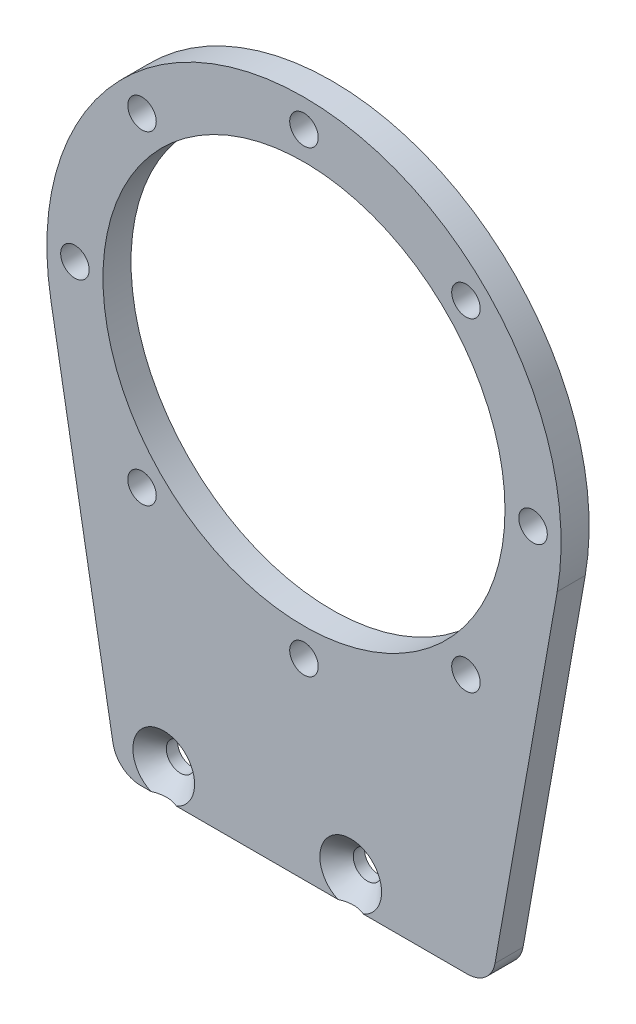
ISO-10303-21;
HEADER;
FILE_DESCRIPTION(('STEP AP214'),'2;1');
FILE_NAME('part.step','',(''),(''),'','','');
FILE_SCHEMA(('AUTOMOTIVE_DESIGN { 1 0 10303 214 1 1 1 1 }'));
ENDSEC;
DATA;
#1=APPLICATION_CONTEXT('core data for automotive mechanical design processes');
#2=APPLICATION_PROTOCOL_DEFINITION('international standard','automotive_design',2000,#1);
#3=PRODUCT_CONTEXT('',#1,'mechanical');
#4=PRODUCT('Part','Part','',(#3));
#5=PRODUCT_RELATED_PRODUCT_CATEGORY('part','',(#4));
#6=PRODUCT_DEFINITION_FORMATION('','',#4);
#7=PRODUCT_DEFINITION_CONTEXT('part definition',#1,'design');
#8=PRODUCT_DEFINITION('design','',#6,#7);
#9=PRODUCT_DEFINITION_SHAPE('','',#8);
#10=(LENGTH_UNIT() NAMED_UNIT(*) SI_UNIT(.MILLI.,.METRE.));
#11=(NAMED_UNIT(*) PLANE_ANGLE_UNIT() SI_UNIT($,.RADIAN.));
#12=(NAMED_UNIT(*) SI_UNIT($,.STERADIAN.) SOLID_ANGLE_UNIT());
#13=UNCERTAINTY_MEASURE_WITH_UNIT(LENGTH_MEASURE(1.E-05),#10,'distance_accuracy_value','');
#14=(GEOMETRIC_REPRESENTATION_CONTEXT(3) GLOBAL_UNCERTAINTY_ASSIGNED_CONTEXT((#13)) GLOBAL_UNIT_ASSIGNED_CONTEXT((#10,
#11,#12)) REPRESENTATION_CONTEXT('',''));
#15=CARTESIAN_POINT('',(0.,0.,0.));
#16=DIRECTION('',(0.,0.,1.));
#17=DIRECTION('',(1.,0.,0.));
#18=AXIS2_PLACEMENT_3D('',#15,#16,#17);
#19=CARTESIAN_POINT('',(20.,-45.,3.));
#20=DIRECTION('',(-0.984851606934607,0.173399285806841,0.));
#21=DIRECTION('',(-0.173399285806841,-0.984851606934607,0.));
#22=AXIS2_PLACEMENT_3D('',#19,#20,#21);
#23=PLANE('',#22);
#24=DIRECTION('',(0.173399285806841,0.984851606934607,0.));
#25=VECTOR('',#24,1.);
#26=CARTESIAN_POINT('',(20.,-45.,3.));
#27=LINE('',#26,#25);
#28=CARTESIAN_POINT('',(20.436609858214,-42.5201978574205,3.));
#29=VERTEX_POINT('',#28);
#30=CARTESIAN_POINT('',(27.0834191907017,-4.76848035968813,3.));
#31=VERTEX_POINT('',#30);
#32=EDGE_CURVE('E130',#29,#31,#27,.T.);
#33=ORIENTED_EDGE('',*,*,#32,.F.);
#34=DIRECTION('',(0.,0.,-1.));
#35=VECTOR('',#34,1.);
#36=CARTESIAN_POINT('',(20.436609858214,-42.5201978574205,3.));
#37=LINE('',#36,#35);
#38=CARTESIAN_POINT('',(20.436609858214,-42.5201978574205,0.));
#39=VERTEX_POINT('',#38);
#40=EDGE_CURVE('E45',#29,#39,#37,.T.);
#41=ORIENTED_EDGE('',*,*,#40,.T.);
#42=DIRECTION('',(0.173399285806841,0.984851606934607,0.));
#43=VECTOR('',#42,1.);
#44=CARTESIAN_POINT('',(20.,-45.,0.));
#45=LINE('',#44,#43);
#46=CARTESIAN_POINT('',(27.0834191907017,-4.76848035968813,0.));
#47=VERTEX_POINT('',#46);
#48=EDGE_CURVE('E142',#39,#47,#45,.T.);
#49=ORIENTED_EDGE('',*,*,#48,.T.);
#50=DIRECTION('',(0.,0.,-1.));
#51=VECTOR('',#50,1.);
#52=CARTESIAN_POINT('',(27.0834191907017,-4.76848035968813,3.));
#53=LINE('',#52,#51);
#54=EDGE_CURVE('E121',#31,#47,#53,.T.);
#55=ORIENTED_EDGE('',*,*,#54,.F.);
#56=EDGE_LOOP('',(#33,#41,#49,#55));
#57=FACE_BOUND('',#56,.T.);
#58=ADVANCED_FACE('F36',(#57),#23,.F.);
#59=CARTESIAN_POINT('',(0.,0.,3.));
#60=DIRECTION('',(0.,0.,-1.));
#61=DIRECTION('',(-1.,0.,0.));
#62=AXIS2_PLACEMENT_3D('',#59,#60,#61);
#63=CYLINDRICAL_SURFACE('',#62,27.5);
#64=CARTESIAN_POINT('',(0.,0.,0.));
#65=DIRECTION('',(0.,0.,1.));
#66=DIRECTION('',(1.,0.,0.));
#67=AXIS2_PLACEMENT_3D('',#64,#65,#66);
#68=CIRCLE('',#67,27.5);
#69=CARTESIAN_POINT('',(-27.0834191907017,-4.76848035968814,0.));
#70=VERTEX_POINT('',#69);
#71=EDGE_CURVE('E331',#47,#70,#68,.T.);
#72=ORIENTED_EDGE('',*,*,#71,.T.);
#73=DIRECTION('',(0.,0.,-1.));
#74=VECTOR('',#73,1.);
#75=CARTESIAN_POINT('',(-27.0834191907017,-4.76848035968814,3.));
#76=LINE('',#75,#74);
#77=CARTESIAN_POINT('',(-27.0834191907017,-4.76848035968814,3.));
#78=VERTEX_POINT('',#77);
#79=EDGE_CURVE('E117',#78,#70,#76,.T.);
#80=ORIENTED_EDGE('',*,*,#79,.F.);
#81=CARTESIAN_POINT('',(0.,0.,3.));
#82=DIRECTION('',(0.,0.,1.));
#83=DIRECTION('',(1.,0.,0.));
#84=AXIS2_PLACEMENT_3D('',#81,#82,#83);
#85=CIRCLE('',#84,27.5);
#86=EDGE_CURVE('E128',#31,#78,#85,.T.);
#87=ORIENTED_EDGE('',*,*,#86,.F.);
#88=ORIENTED_EDGE('',*,*,#54,.T.);
#89=EDGE_LOOP('',(#72,#80,#87,#88));
#90=FACE_BOUND('',#89,.T.);
#91=ADVANCED_FACE('F273',(#90),#63,.T.);
#92=CARTESIAN_POINT('',(-20.,-45.,3.));
#93=DIRECTION('',(0.984851606934607,0.173399285806841,0.));
#94=DIRECTION('',(-0.173399285806841,0.984851606934607,0.));
#95=AXIS2_PLACEMENT_3D('',#92,#93,#94);
#96=PLANE('',#95);
#97=DIRECTION('',(0.173399285806841,-0.984851606934607,0.));
#98=VECTOR('',#97,1.);
#99=CARTESIAN_POINT('',(-20.,-45.,0.));
#100=LINE('',#99,#98);
#101=CARTESIAN_POINT('',(-20.436609858214,-42.5201978574205,0.));
#102=VERTEX_POINT('',#101);
#103=EDGE_CURVE('E329',#70,#102,#100,.T.);
#104=ORIENTED_EDGE('',*,*,#103,.T.);
#105=DIRECTION('',(0.,0.,-1.));
#106=VECTOR('',#105,1.);
#107=CARTESIAN_POINT('',(-20.436609858214,-42.5201978574205,3.));
#108=LINE('',#107,#106);
#109=CARTESIAN_POINT('',(-20.436609858214,-42.5201978574205,3.));
#110=VERTEX_POINT('',#109);
#111=EDGE_CURVE('E288',#102,#110,#108,.F.);
#112=ORIENTED_EDGE('',*,*,#111,.T.);
#113=DIRECTION('',(0.173399285806841,-0.984851606934607,0.));
#114=VECTOR('',#113,1.);
#115=CARTESIAN_POINT('',(-20.,-45.,3.));
#116=LINE('',#115,#114);
#117=EDGE_CURVE('E125',#78,#110,#116,.T.);
#118=ORIENTED_EDGE('',*,*,#117,.F.);
#119=ORIENTED_EDGE('',*,*,#79,.T.);
#120=EDGE_LOOP('',(#104,#112,#118,#119));
#121=FACE_BOUND('',#120,.T.);
#122=ADVANCED_FACE('F207',(#121),#96,.F.);
#123=CARTESIAN_POINT('',(-20.,-45.,3.));
#124=DIRECTION('',(0.,1.,0.));
#125=DIRECTION('',(-1.,0.,0.));
#126=AXIS2_PLACEMENT_3D('',#123,#124,#125);
#127=PLANE('',#126);
#128=DIRECTION('',(1.,0.,0.));
#129=VECTOR('',#128,1.);
#130=CARTESIAN_POINT('',(-20.,-45.,3.));
#131=LINE('',#130,#129);
#132=CARTESIAN_POINT('',(-13.6252272915131,-45.,3.));
#133=VERTEX_POINT('',#132);
#134=CARTESIAN_POINT('',(3.62522729151328,-45.,3.));
#135=VERTEX_POINT('',#134);
#136=EDGE_CURVE('E58',#133,#135,#131,.T.);
#137=ORIENTED_EDGE('',*,*,#136,.F.);
#138=CARTESIAN_POINT('',(-19.1508860129065,-45.,4.82150902490101));
#139=CARTESIAN_POINT('',(-19.0522589239576,-45.,4.7415906121361));
#140=CARTESIAN_POINT('',(-18.9531658036234,-45.,4.66223927028797));
#141=CARTESIAN_POINT('',(-18.7538370988954,-45.,4.50494526327476));
#142=CARTESIAN_POINT('',(-18.6536012929923,-45.,4.4270028790763));
#143=CARTESIAN_POINT('',(-18.4510624969044,-45.,4.27225770788909));
#144=CARTESIAN_POINT('',(-18.3487496614384,-45.,4.19546776946498));
#145=CARTESIAN_POINT('',(-18.1425481151415,-45.,4.04404278391068));
#146=CARTESIAN_POINT('',(-18.0386595087374,-45.,3.96940759492787));
#147=CARTESIAN_POINT('',(-17.8201887261708,-45.,3.81665595341967));
#148=CARTESIAN_POINT('',(-17.7054416805852,-45.,3.73877417270123));
#149=CARTESIAN_POINT('',(-17.4732515877197,-45.,3.58706104918413));
#150=CARTESIAN_POINT('',(-17.3558080124541,-45.,3.51323050938684));
#151=CARTESIAN_POINT('',(-17.1180615491722,-45.,3.37112041781764));
#152=CARTESIAN_POINT('',(-16.9977682701096,-45.,3.30282491480009));
#153=CARTESIAN_POINT('',(-16.753459335704,-45.,3.17331164024902));
#154=CARTESIAN_POINT('',(-16.6294456757632,-45.,3.11209015717064));
#155=CARTESIAN_POINT('',(-16.3956113355616,-45.,3.00733640420947));
#156=CARTESIAN_POINT('',(-16.2863687778311,-45.,2.96252657017206));
#157=CARTESIAN_POINT('',(-16.0646355941592,-45.,2.88163524822732));
#158=CARTESIAN_POINT('',(-15.9521447639429,-45.,2.84555431059981));
#159=CARTESIAN_POINT('',(-15.7265795792497,-45.,2.78486376508149));
#160=CARTESIAN_POINT('',(-15.6135667549767,-45.,2.76002979511898));
#161=CARTESIAN_POINT('',(-15.3855224244365,-45.,2.72258306176409));
#162=CARTESIAN_POINT('',(-15.2704916638217,-45.,2.70996587708434));
#163=CARTESIAN_POINT('',(-15.0478592490485,-45.,2.69846838235778));
#164=CARTESIAN_POINT('',(-14.9403045307317,-45.,2.69868375553161));
#165=CARTESIAN_POINT('',(-14.725842911363,-45.,2.71059719396083));
#166=CARTESIAN_POINT('',(-14.6189360303921,-45.,2.72229561334384));
#167=CARTESIAN_POINT('',(-14.4059364127219,-45.,2.75642733136527));
#168=CARTESIAN_POINT('',(-14.2998586797189,-45.,2.77895246227706));
#169=CARTESIAN_POINT('',(-14.090139990422,-45.,2.83330190120473));
#170=CARTESIAN_POINT('',(-13.9864996608889,-45.,2.86512857339727));
#171=CARTESIAN_POINT('',(-13.6896269574193,-45.,2.96859641772816));
#172=CARTESIAN_POINT('',(-13.4998859416964,-45.,3.05025935947392));
#173=CARTESIAN_POINT('',(-13.2221139564557,-45.,3.18631355502083));
#174=CARTESIAN_POINT('',(-13.1305739158924,-45.,3.23398013062563));
#175=CARTESIAN_POINT('',(-12.9495108226937,-45.,3.33300917158717));
#176=CARTESIAN_POINT('',(-12.8599874640647,-45.,3.38437107122038));
#177=CARTESIAN_POINT('',(-12.6814996168162,-45.,3.49081029949074));
#178=CARTESIAN_POINT('',(-12.592560311294,-45.,3.54592943734986));
#179=CARTESIAN_POINT('',(-12.4162791184772,-45.,3.65866432764966));
#180=CARTESIAN_POINT('',(-12.3289372668912,-45.,3.71628013580284));
#181=CARTESIAN_POINT('',(-12.1557220917774,-45.,3.83350405674633));
#182=CARTESIAN_POINT('',(-12.0698474993291,-45.,3.8931103009978));
#183=CARTESIAN_POINT('',(-11.8993042810776,-45.,4.01401202334735));
#184=CARTESIAN_POINT('',(-11.8146356035005,-45.,4.07530742859053));
#185=CARTESIAN_POINT('',(-11.6246641299745,-45.,4.21528143960808));
#186=CARTESIAN_POINT('',(-11.5196642043875,-45.,4.29437065836093));
#187=CARTESIAN_POINT('',(-11.311047978828,-45.,4.45435587527189));
#188=CARTESIAN_POINT('',(-11.2074317330192,-45.,4.53525194382896));
#189=CARTESIAN_POINT('',(-10.8982966873547,-45.,4.78016475749427));
#190=CARTESIAN_POINT('',(-10.6945224866147,-45.,4.94638302543725));
#191=CARTESIAN_POINT('',(-10.290242088986,-45.,5.28295074125445));
#192=CARTESIAN_POINT('',(-10.0897378197545,-45.,5.45330248842023));
#193=CARTESIAN_POINT('',(-9.69125122070904,-45.,5.79693738204447));
#194=CARTESIAN_POINT('',(-9.49326897003109,-45.,5.97022062009199));
#195=CARTESIAN_POINT('',(-9.09874452273209,-45.,6.31939365427462));
#196=CARTESIAN_POINT('',(-8.90220711507222,-45.,6.49528884888159));
#197=CARTESIAN_POINT('',(-8.51064142991948,-45.,6.84875582087548));
#198=CARTESIAN_POINT('',(-8.3156131800658,-45.,7.02632762883681));
#199=CARTESIAN_POINT('',(-7.73244703544708,-45.,7.56085126104374));
#200=CARTESIAN_POINT('',(-7.34608461642984,-45.,7.9197390262219));
#201=CARTESIAN_POINT('',(-6.62771800127958,-45.,8.59278923550418));
#202=CARTESIAN_POINT('',(-6.29532815840837,-45.,8.90654168888206));
#203=CARTESIAN_POINT('',(-5.63221724310256,-45.,9.5358745233835));
#204=CARTESIAN_POINT('',(-5.30149635028805,-45.,9.85145509372474));
#205=CARTESIAN_POINT('',(-4.64278279309385,-45.,10.4825349477892));
#206=CARTESIAN_POINT('',(-4.31478453306716,-45.,10.7980283978303));
#207=CARTESIAN_POINT('',(-3.65980728215403,-45.,11.4299939790683));
#208=CARTESIAN_POINT('',(-3.33282817461386,-45.,11.7464659893283));
#209=CARTESIAN_POINT('',(-3.00620195253253,-45.,12.063300190622));
#210=B_SPLINE_CURVE_WITH_KNOTS('',3,(#138,#139,#140,#141,#142,#143,#144,#145,#146,#147,#148,
#149,#150,#151,#152,#153,#154,#155,#156,#157,#158,#159,#160,#161,#162,#163,#164,#165,#166,#167,
#168,#169,#170,#171,#172,#173,#174,#175,#176,#177,#178,#179,#180,#181,#182,#183,#184,#185,#186,
#187,#188,#189,#190,#191,#192,#193,#194,#195,#196,#197,#198,#199,#200,#201,#202,#203,#204,#205,
#206,#207,#208,#209),.UNSPECIFIED.,.F.,.F.,(4,2,2,2,2,2,2,2,2,2,2,2,2,2,2,2,2,2,2,2,2,2,2,2,2,2,
2,2,2,2,2,2,2,2,2,4),(0.,0.380831228692744,0.761737581045333,1.1454870746135,1.52921124710498,
1.94518824022884,2.3612473890146,2.77606139361267,3.19065675878268,3.5445929654488,
3.8985514788551,4.24509904888171,4.59152115548498,4.91356170339058,5.23561218307134,
5.56044383963398,5.88535813070529,6.5032823542334,6.81287268782773,7.12241572614238,
7.43627338380023,7.750138048713,8.06371592505691,8.37728029763189,8.77161606250795,
9.16596721849107,9.95478521299294,10.7440525382388,11.5333445684055,12.3245940288198,
13.1158579462859,14.6978103234965,16.069048800809,17.4404318374958,18.8057393721757,
20.1708844273189),.UNSPECIFIED.);
#211=CARTESIAN_POINT('',(-16.3747727084869,-45.,3.));
#212=VERTEX_POINT('',#211);
#213=EDGE_CURVE('E51',#133,#212,#210,.F.);
#214=ORIENTED_EDGE('',*,*,#213,.T.);
#215=CARTESIAN_POINT('',(-17.4820550374102,-45.,3.));
#216=VERTEX_POINT('',#215);
#217=EDGE_CURVE('E108',#216,#212,#131,.T.);
#218=ORIENTED_EDGE('',*,*,#217,.F.);
#219=DIRECTION('',(0.,0.,-1.));
#220=VECTOR('',#219,1.);
#221=CARTESIAN_POINT('',(-17.4820550374102,-45.,3.));
#222=LINE('',#221,#220);
#223=CARTESIAN_POINT('',(-17.4820550374102,-45.,0.));
#224=VERTEX_POINT('',#223);
#225=EDGE_CURVE('E289',#216,#224,#222,.T.);
#226=ORIENTED_EDGE('',*,*,#225,.T.);
#227=DIRECTION('',(1.,0.,0.));
#228=VECTOR('',#227,1.);
#229=CARTESIAN_POINT('',(-20.,-45.,0.));
#230=LINE('',#229,#228);
#231=CARTESIAN_POINT('',(17.4820550374102,-45.,0.));
#232=VERTEX_POINT('',#231);
#233=EDGE_CURVE('E134',#224,#232,#230,.T.);
#234=ORIENTED_EDGE('',*,*,#233,.T.);
#235=DIRECTION('',(0.,0.,-1.));
#236=VECTOR('',#235,1.);
#237=CARTESIAN_POINT('',(17.4820550374102,-45.,3.));
#238=LINE('',#237,#236);
#239=CARTESIAN_POINT('',(17.4820550374102,-45.,3.));
#240=VERTEX_POINT('',#239);
#241=EDGE_CURVE('E337',#232,#240,#238,.F.);
#242=ORIENTED_EDGE('',*,*,#241,.T.);
#243=CARTESIAN_POINT('',(6.37477270848671,-45.,3.));
#244=VERTEX_POINT('',#243);
#245=EDGE_CURVE('E119',#244,#240,#131,.T.);
#246=ORIENTED_EDGE('',*,*,#245,.F.);
#247=CARTESIAN_POINT('',(-6.18061670059786,-45.,11.2761042585875));
#248=CARTESIAN_POINT('',(-5.8914359782964,-45.,10.9968284293495));
#249=CARTESIAN_POINT('',(-5.60191499361549,-45.,10.7179033624293));
#250=CARTESIAN_POINT('',(-5.0219320848842,-45.,10.1609948468987));
#251=CARTESIAN_POINT('',(-4.7314700995584,-45.,9.88301146212128));
#252=CARTESIAN_POINT('',(-4.14848308527101,-45.,9.32740580500053));
#253=CARTESIAN_POINT('',(-3.85595445417461,-45.,9.04978730807811));
#254=CARTESIAN_POINT('',(-3.26937127500692,-45.,8.49619795936264));
#255=CARTESIAN_POINT('',(-2.97531680922507,-45.,8.22022702040681));
#256=CARTESIAN_POINT('',(-2.34841034771812,-45.,7.63627343134944));
#257=CARTESIAN_POINT('',(-2.01528562759455,-45.,7.3285825689086));
#258=CARTESIAN_POINT('',(-1.51272018892,-45.,6.87013745429984));
#259=CARTESIAN_POINT('',(-1.34470270914723,-45.,6.71782343020518));
#260=CARTESIAN_POINT('',(-1.00749357345925,-45.,6.41450168261448));
#261=CARTESIAN_POINT('',(-0.83830192674175,-45.,6.26349394890655));
#262=CARTESIAN_POINT('',(-0.498758280129591,-45.,5.96338930928497));
#263=CARTESIAN_POINT('',(-0.328408834084627,-45.,5.81428951787767));
#264=CARTESIAN_POINT('',(0.0141201774465905,-45.,5.5182102408462));
#265=CARTESIAN_POINT('',(0.186299699498851,-45.,5.37123070509537));
#266=CARTESIAN_POINT('',(0.532960832064427,-45.,5.08010971511442));
#267=CARTESIAN_POINT('',(0.70744175586468,-45.,4.93596744489988));
#268=CARTESIAN_POINT('',(1.05945862850155,-45.,4.65147233563209));
#269=CARTESIAN_POINT('',(1.23699427948962,-45.,4.51111913051926));
#270=CARTESIAN_POINT('',(1.51309982180886,-45.,4.29941977398574));
#271=CARTESIAN_POINT('',(1.61021671689676,-45.,4.22617934259312));
#272=CARTESIAN_POINT('',(1.80585013617963,-45.,4.08157995364531));
#273=CARTESIAN_POINT('',(1.90436670561209,-45.,4.01022105711518));
#274=CARTESIAN_POINT('',(2.10318884218363,-45.,3.86971942036077));
#275=CARTESIAN_POINT('',(2.20349681414434,-45.,3.80058007248981));
#276=CARTESIAN_POINT('',(2.40605732281094,-45.,3.66520610131397));
#277=CARTESIAN_POINT('',(2.5083097885004,-45.,3.59897137221813));
#278=CARTESIAN_POINT('',(2.71338388615321,-45.,3.47124437264389));
#279=CARTESIAN_POINT('',(2.81616749242238,-45.,3.40969137313386));
#280=CARTESIAN_POINT('',(3.02434529569787,-45.,3.29108487762925));
#281=CARTESIAN_POINT('',(3.12974000368696,-45.,3.23403227163195));
#282=CARTESIAN_POINT('',(3.34323726284334,-45.,3.12584483352875));
#283=CARTESIAN_POINT('',(3.45133282028706,-45.,3.07469632468184));
#284=CARTESIAN_POINT('',(3.67070539180562,-45.,2.97982574972149));
#285=CARTESIAN_POINT('',(3.78198035559313,-45.,2.93609901844546));
#286=CARTESIAN_POINT('',(3.98745941627403,-45.,2.86507518637899));
#287=CARTESIAN_POINT('',(4.08112674605892,-45.,2.83623737364351));
#288=CARTESIAN_POINT('',(4.270480159168,-45.,2.7860772914338));
#289=CARTESIAN_POINT('',(4.36616616110235,-45.,2.76475471956765));
#290=CARTESIAN_POINT('',(4.55853045685127,-45.,2.7308401624933));
#291=CARTESIAN_POINT('',(4.65519988372438,-45.,2.71819869094007));
#292=CARTESIAN_POINT('',(4.84931137012863,-45.,2.70222563762937));
#293=CARTESIAN_POINT('',(4.94675335674288,-45.,2.69889318750128));
#294=CARTESIAN_POINT('',(5.13893623890647,-45.,2.70171814635444));
#295=CARTESIAN_POINT('',(5.23368091646792,-45.,2.70762882766535));
#296=CARTESIAN_POINT('',(5.42221877331271,-45.,2.72811507032909));
#297=CARTESIAN_POINT('',(5.51601189276624,-45.,2.7426911731336));
#298=CARTESIAN_POINT('',(5.70254535713979,-45.,2.77979863135181));
#299=CARTESIAN_POINT('',(5.795276595249,-45.,2.80237507316296));
#300=CARTESIAN_POINT('',(5.9787707141461,-45.,2.85440076211779));
#301=CARTESIAN_POINT('',(6.06953344033122,-45.,2.88385054695837));
#302=CARTESIAN_POINT('',(6.26068128437981,-45.,2.95274635741036));
#303=CARTESIAN_POINT('',(6.36077439559764,-45.,2.99299568551352));
#304=CARTESIAN_POINT('',(6.55836680433632,-45.,3.07943905313335));
#305=CARTESIAN_POINT('',(6.65586523732688,-45.,3.12563504484086));
#306=CARTESIAN_POINT('',(6.8486236521163,-45.,3.22284985154173));
#307=CARTESIAN_POINT('',(6.9438793972132,-45.,3.27387700261107));
#308=CARTESIAN_POINT('',(7.13222755442895,-45.,3.37971851133287));
#309=CARTESIAN_POINT('',(7.22532033634855,-45.,3.43453221513774));
#310=CARTESIAN_POINT('',(7.41085290984727,-45.,3.54795428080618));
#311=CARTESIAN_POINT('',(7.50326775247536,-45.,3.60660326351876));
#312=CARTESIAN_POINT('',(7.68643863774753,-45.,3.72643224728756));
#313=CARTESIAN_POINT('',(7.77719463615234,-45.,3.78761231570305));
#314=CARTESIAN_POINT('',(7.95718224207088,-45.,3.91197069670986));
#315=CARTESIAN_POINT('',(8.04641535057457,-45.,3.97514684299531));
#316=CARTESIAN_POINT('',(8.22364562865434,-45.,4.10319773861951));
#317=CARTESIAN_POINT('',(8.31164284567419,-45.,4.16807242247894));
#318=CARTESIAN_POINT('',(8.60428647214979,-45.,4.3874665267982));
#319=CARTESIAN_POINT('',(8.80656358954741,-45.,4.54514638586982));
#320=CARTESIAN_POINT('',(9.20697912450419,-45.,4.86569108327737));
#321=CARTESIAN_POINT('',(9.40511686115475,-45.,5.02855676370636));
#322=CARTESIAN_POINT('',(9.79841178829449,-45.,5.35802321404988));
#323=CARTESIAN_POINT('',(9.99356754771611,-45.,5.52462568813699));
#324=CARTESIAN_POINT('',(10.3815648867815,-45.,5.86050564328988));
#325=CARTESIAN_POINT('',(10.5744064055927,-45.,6.0297831944035));
#326=CARTESIAN_POINT('',(10.9587249521017,-45.,6.37072136850707));
#327=CARTESIAN_POINT('',(11.1501980586121,-45.,6.54238640454117));
#328=CARTESIAN_POINT('',(11.5317363241419,-45.,6.88727715839225));
#329=CARTESIAN_POINT('',(11.7218014629661,-45.,7.0605028985165));
#330=CARTESIAN_POINT('',(12.2902143717919,-45.,7.58189622425851));
#331=CARTESIAN_POINT('',(12.6668936964081,-45.,7.93188188445103));
#332=CARTESIAN_POINT('',(13.3732010694563,-45.,8.59366505258181));
#333=CARTESIAN_POINT('',(13.703155288647,-45.,8.90511573971248));
#334=CARTESIAN_POINT('',(14.3614114763272,-45.,9.52981458315141));
#335=CARTESIAN_POINT('',(14.6897132995227,-45.,9.843062892514));
#336=CARTESIAN_POINT('',(15.3437775371707,-45.,10.4696307435521));
#337=CARTESIAN_POINT('',(15.6695448608986,-45.,10.7829451664577));
#338=CARTESIAN_POINT('',(16.3200757556826,-45.,11.4105498443116));
#339=CARTESIAN_POINT('',(16.6448394235426,-45.,11.7248399988907));
#340=CARTESIAN_POINT('',(16.9692526784864,-45.,12.0394898468881));
#341=B_SPLINE_CURVE_WITH_KNOTS('',3,(#247,#248,#249,#250,#251,#252,#253,#254,#255,#256,#257,
#258,#259,#260,#261,#262,#263,#264,#265,#266,#267,#268,#269,#270,#271,#272,#273,#274,#275,#276,
#277,#278,#279,#280,#281,#282,#283,#284,#285,#286,#287,#288,#289,#290,#291,#292,#293,#294,#295,
#296,#297,#298,#299,#300,#301,#302,#303,#304,#305,#306,#307,#308,#309,#310,#311,#312,#313,#314,
#315,#316,#317,#318,#319,#320,#321,#322,#323,#324,#325,#326,#327,#328,#329,#330,#331,#332,#333,
#334,#335,#336,#337,#338,#339,#340),.UNSPECIFIED.,.F.,.F.,(4,2,2,2,2,2,2,2,2,2,2,2,2,2,2,2,2,2,
2,2,2,2,2,2,2,2,2,2,2,2,2,2,2,2,2,2,2,2,2,2,2,2,2,2,2,2,4),(0.,1.2060627764022,2.4122057336306,
3.62207878706078,4.83188725555652,6.19230458826314,6.87264126221327,7.55297261282554,
8.23211141120563,8.91123412711992,9.59015858936811,10.2690172246445,10.6339142941056,
10.9988231839941,11.3642655416603,11.7296945782481,12.0890206356012,12.4484175760035,
12.8069645226723,13.1652852533669,13.4590426211787,13.7527881676802,14.0448450079142,
14.336874603389,14.6212410825542,14.9056253319908,15.1916384231198,15.4776738963605,
15.8010779719719,16.1245884878204,16.4486677576676,16.772691205945,17.1010031051629,
17.4293237473051,17.7572995449476,18.0852627175525,18.8545364666871,19.6239357769,
20.393693409931,21.1634712328482,21.9349376784546,22.7064151682337,24.2489111984032,
25.6100960777974,26.9713986244381,28.3273508554696,29.6831679444807),.UNSPECIFIED.);
#342=EDGE_CURVE('E11',#244,#135,#341,.F.);
#343=ORIENTED_EDGE('',*,*,#342,.T.);
#344=EDGE_LOOP('',(#137,#214,#218,#226,#234,#242,#246,#343));
#345=FACE_BOUND('',#344,.T.);
#346=ADVANCED_FACE('F106',(#345),#127,.F.);
#347=CARTESIAN_POINT('',(0.,0.,3.));
#348=DIRECTION('',(0.,0.,1.));
#349=DIRECTION('',(1.,0.,0.));
#350=AXIS2_PLACEMENT_3D('',#347,#348,#349);
#351=PLANE('',#350);
#352=CARTESIAN_POINT('',(-15.,-42.,3.));
#353=DIRECTION('',(0.,0.,1.));
#354=DIRECTION('',(1.,0.,0.));
#355=AXIS2_PLACEMENT_3D('',#352,#353,#354);
#356=CIRCLE('',#355,3.3);
#357=EDGE_CURVE('E100',#133,#212,#356,.T.);
#358=ORIENTED_EDGE('',*,*,#357,.F.);
#359=ORIENTED_EDGE('',*,*,#136,.T.);
#360=CARTESIAN_POINT('',(5.,-42.,3.));
#361=DIRECTION('',(0.,0.,1.));
#362=DIRECTION('',(1.,0.,0.));
#363=AXIS2_PLACEMENT_3D('',#360,#361,#362);
#364=CIRCLE('',#363,3.3);
#365=EDGE_CURVE('E110',#244,#135,#364,.T.);
#366=ORIENTED_EDGE('',*,*,#365,.F.);
#367=ORIENTED_EDGE('',*,*,#245,.T.);
#368=CARTESIAN_POINT('',(17.4820550374102,-42.,3.));
#369=DIRECTION('',(0.,0.,1.));
#370=DIRECTION('',(1.,0.,0.));
#371=AXIS2_PLACEMENT_3D('',#368,#369,#370);
#372=CIRCLE('',#371,3.);
#373=EDGE_CURVE('E290',#240,#29,#372,.T.);
#374=ORIENTED_EDGE('',*,*,#373,.T.);
#375=ORIENTED_EDGE('',*,*,#32,.T.);
#376=ORIENTED_EDGE('',*,*,#86,.T.);
#377=ORIENTED_EDGE('',*,*,#117,.T.);
#378=CARTESIAN_POINT('',(-17.4820550374102,-42.,3.));
#379=DIRECTION('',(0.,0.,1.));
#380=DIRECTION('',(1.,0.,0.));
#381=AXIS2_PLACEMENT_3D('',#378,#379,#380);
#382=CIRCLE('',#381,3.);
#383=EDGE_CURVE('E116',#110,#216,#382,.T.);
#384=ORIENTED_EDGE('',*,*,#383,.T.);
#385=ORIENTED_EDGE('',*,*,#217,.T.);
#386=EDGE_LOOP('',(#358,#359,#366,#367,#374,#375,#376,#377,#384,#385));
#387=FACE_BOUND('',#386,.T.);
#388=CARTESIAN_POINT('',(24.5,0.,3.));
#389=DIRECTION('',(0.,0.,1.));
#390=DIRECTION('',(1.,0.,0.));
#391=AXIS2_PLACEMENT_3D('',#388,#389,#390);
#392=CIRCLE('',#391,1.525);
#393=CARTESIAN_POINT('',(26.025,0.,3.));
#394=VERTEX_POINT('',#393);
#395=EDGE_CURVE('E168',#394,#394,#392,.T.);
#396=ORIENTED_EDGE('',*,*,#395,.F.);
#397=EDGE_LOOP('',(#396));
#398=FACE_BOUND('',#397,.T.);
#399=CARTESIAN_POINT('',(17.3241161390704,-17.3241161390705,3.));
#400=DIRECTION('',(0.,0.,1.));
#401=DIRECTION('',(1.,0.,0.));
#402=AXIS2_PLACEMENT_3D('',#399,#400,#401);
#403=CIRCLE('',#402,1.525);
#404=CARTESIAN_POINT('',(18.8491161390704,-17.3241161390705,3.));
#405=VERTEX_POINT('',#404);
#406=EDGE_CURVE('E162',#405,#405,#403,.T.);
#407=ORIENTED_EDGE('',*,*,#406,.F.);
#408=EDGE_LOOP('',(#407));
#409=FACE_BOUND('',#408,.T.);
#410=CARTESIAN_POINT('',(0.,-24.5,3.));
#411=DIRECTION('',(0.,0.,1.));
#412=DIRECTION('',(1.,0.,0.));
#413=AXIS2_PLACEMENT_3D('',#410,#411,#412);
#414=CIRCLE('',#413,1.525);
#415=CARTESIAN_POINT('',(1.52499999999995,-24.5,3.));
#416=VERTEX_POINT('',#415);
#417=EDGE_CURVE('E156',#416,#416,#414,.T.);
#418=ORIENTED_EDGE('',*,*,#417,.F.);
#419=EDGE_LOOP('',(#418));
#420=FACE_BOUND('',#419,.T.);
#421=CARTESIAN_POINT('',(-17.3241161390704,-17.3241161390704,3.));
#422=DIRECTION('',(0.,0.,1.));
#423=DIRECTION('',(1.,0.,0.));
#424=AXIS2_PLACEMENT_3D('',#421,#422,#423);
#425=CIRCLE('',#424,1.525);
#426=CARTESIAN_POINT('',(-15.7991161390704,-17.3241161390704,3.));
#427=VERTEX_POINT('',#426);
#428=EDGE_CURVE('E149',#427,#427,#425,.T.);
#429=ORIENTED_EDGE('',*,*,#428,.F.);
#430=EDGE_LOOP('',(#429));
#431=FACE_BOUND('',#430,.T.);
#432=CARTESIAN_POINT('',(-24.5,0.,3.));
#433=DIRECTION('',(0.,0.,1.));
#434=DIRECTION('',(1.,0.,0.));
#435=AXIS2_PLACEMENT_3D('',#432,#433,#434);
#436=CIRCLE('',#435,1.525);
#437=CARTESIAN_POINT('',(-22.975,0.,3.));
#438=VERTEX_POINT('',#437);
#439=EDGE_CURVE('E186',#438,#438,#436,.T.);
#440=ORIENTED_EDGE('',*,*,#439,.F.);
#441=EDGE_LOOP('',(#440));
#442=FACE_BOUND('',#441,.T.);
#443=CARTESIAN_POINT('',(-17.3241161390704,17.3241161390704,3.));
#444=DIRECTION('',(0.,0.,1.));
#445=DIRECTION('',(1.,0.,0.));
#446=AXIS2_PLACEMENT_3D('',#443,#444,#445);
#447=CIRCLE('',#446,1.525);
#448=CARTESIAN_POINT('',(-15.7991161390704,17.3241161390704,3.));
#449=VERTEX_POINT('',#448);
#450=EDGE_CURVE('E180',#449,#449,#447,.T.);
#451=ORIENTED_EDGE('',*,*,#450,.F.);
#452=EDGE_LOOP('',(#451));
#453=FACE_BOUND('',#452,.T.);
#454=CARTESIAN_POINT('',(0.,24.5,3.));
#455=DIRECTION('',(0.,0.,1.));
#456=DIRECTION('',(1.,0.,0.));
#457=AXIS2_PLACEMENT_3D('',#454,#455,#456);
#458=CIRCLE('',#457,1.525);
#459=CARTESIAN_POINT('',(1.52500000000004,24.5,3.));
#460=VERTEX_POINT('',#459);
#461=EDGE_CURVE('E173',#460,#460,#458,.T.);
#462=ORIENTED_EDGE('',*,*,#461,.F.);
#463=EDGE_LOOP('',(#462));
#464=FACE_BOUND('',#463,.T.);
#465=CARTESIAN_POINT('',(17.3241161390705,17.3241161390704,3.));
#466=DIRECTION('',(0.,0.,1.));
#467=DIRECTION('',(1.,0.,0.));
#468=AXIS2_PLACEMENT_3D('',#465,#466,#467);
#469=CIRCLE('',#468,1.525);
#470=CARTESIAN_POINT('',(18.8491161390704,17.3241161390704,3.));
#471=VERTEX_POINT('',#470);
#472=EDGE_CURVE('E143',#471,#471,#469,.T.);
#473=ORIENTED_EDGE('',*,*,#472,.F.);
#474=EDGE_LOOP('',(#473));
#475=FACE_BOUND('',#474,.T.);
#476=CARTESIAN_POINT('',(0.,0.,3.));
#477=DIRECTION('',(0.,0.,1.));
#478=DIRECTION('',(1.,0.,0.));
#479=AXIS2_PLACEMENT_3D('',#476,#477,#478);
#480=CIRCLE('',#479,21.5);
#481=CARTESIAN_POINT('',(21.5,0.,3.));
#482=VERTEX_POINT('',#481);
#483=EDGE_CURVE('E135',#482,#482,#480,.T.);
#484=ORIENTED_EDGE('',*,*,#483,.F.);
#485=EDGE_LOOP('',(#484));
#486=FACE_BOUND('',#485,.T.);
#487=ADVANCED_FACE('F112',(#387,#398,#409,#420,#431,#442,#453,#464,#475,#486),#351,.T.);
#488=CARTESIAN_POINT('',(0.,0.,0.));
#489=DIRECTION('',(0.,0.,1.));
#490=DIRECTION('',(1.,0.,0.));
#491=AXIS2_PLACEMENT_3D('',#488,#489,#490);
#492=PLANE('',#491);
#493=CARTESIAN_POINT('',(-15.,-42.,0.));
#494=DIRECTION('',(0.,0.,1.));
#495=DIRECTION('',(1.,0.,0.));
#496=AXIS2_PLACEMENT_3D('',#493,#494,#495);
#497=CIRCLE('',#496,1.515);
#498=CARTESIAN_POINT('',(-13.485,-42.,0.));
#499=VERTEX_POINT('',#498);
#500=EDGE_CURVE('E177',#499,#499,#497,.T.);
#501=ORIENTED_EDGE('',*,*,#500,.T.);
#502=EDGE_LOOP('',(#501));
#503=FACE_BOUND('',#502,.T.);
#504=CARTESIAN_POINT('',(5.,-42.,0.));
#505=DIRECTION('',(0.,0.,1.));
#506=DIRECTION('',(1.,0.,0.));
#507=AXIS2_PLACEMENT_3D('',#504,#505,#506);
#508=CIRCLE('',#507,1.515);
#509=CARTESIAN_POINT('',(6.515,-42.,0.));
#510=VERTEX_POINT('',#509);
#511=EDGE_CURVE('E194',#510,#510,#508,.T.);
#512=ORIENTED_EDGE('',*,*,#511,.T.);
#513=EDGE_LOOP('',(#512));
#514=FACE_BOUND('',#513,.T.);
#515=CARTESIAN_POINT('',(24.5,0.,0.));
#516=DIRECTION('',(0.,0.,1.));
#517=DIRECTION('',(1.,0.,0.));
#518=AXIS2_PLACEMENT_3D('',#515,#516,#517);
#519=CIRCLE('',#518,1.525);
#520=CARTESIAN_POINT('',(26.025,0.,0.));
#521=VERTEX_POINT('',#520);
#522=EDGE_CURVE('E146',#521,#521,#519,.T.);
#523=ORIENTED_EDGE('',*,*,#522,.T.);
#524=EDGE_LOOP('',(#523));
#525=FACE_BOUND('',#524,.T.);
#526=CARTESIAN_POINT('',(17.3241161390704,-17.3241161390705,0.));
#527=DIRECTION('',(0.,0.,1.));
#528=DIRECTION('',(1.,0.,0.));
#529=AXIS2_PLACEMENT_3D('',#526,#527,#528);
#530=CIRCLE('',#529,1.525);
#531=CARTESIAN_POINT('',(18.8491161390704,-17.3241161390705,0.));
#532=VERTEX_POINT('',#531);
#533=EDGE_CURVE('E165',#532,#532,#530,.T.);
#534=ORIENTED_EDGE('',*,*,#533,.T.);
#535=EDGE_LOOP('',(#534));
#536=FACE_BOUND('',#535,.T.);
#537=CARTESIAN_POINT('',(0.,-24.5,0.));
#538=DIRECTION('',(0.,0.,1.));
#539=DIRECTION('',(1.,0.,0.));
#540=AXIS2_PLACEMENT_3D('',#537,#538,#539);
#541=CIRCLE('',#540,1.525);
#542=CARTESIAN_POINT('',(1.52499999999995,-24.5,0.));
#543=VERTEX_POINT('',#542);
#544=EDGE_CURVE('E159',#543,#543,#541,.T.);
#545=ORIENTED_EDGE('',*,*,#544,.T.);
#546=EDGE_LOOP('',(#545));
#547=FACE_BOUND('',#546,.T.);
#548=CARTESIAN_POINT('',(-17.3241161390704,-17.3241161390704,0.));
#549=DIRECTION('',(0.,0.,1.));
#550=DIRECTION('',(1.,0.,0.));
#551=AXIS2_PLACEMENT_3D('',#548,#549,#550);
#552=CIRCLE('',#551,1.525);
#553=CARTESIAN_POINT('',(-15.7991161390704,-17.3241161390704,0.));
#554=VERTEX_POINT('',#553);
#555=EDGE_CURVE('E152',#554,#554,#552,.T.);
#556=ORIENTED_EDGE('',*,*,#555,.T.);
#557=EDGE_LOOP('',(#556));
#558=FACE_BOUND('',#557,.T.);
#559=CARTESIAN_POINT('',(-24.5,0.,0.));
#560=DIRECTION('',(0.,0.,1.));
#561=DIRECTION('',(1.,0.,0.));
#562=AXIS2_PLACEMENT_3D('',#559,#560,#561);
#563=CIRCLE('',#562,1.525);
#564=CARTESIAN_POINT('',(-22.975,0.,0.));
#565=VERTEX_POINT('',#564);
#566=EDGE_CURVE('E153',#565,#565,#563,.T.);
#567=ORIENTED_EDGE('',*,*,#566,.T.);
#568=EDGE_LOOP('',(#567));
#569=FACE_BOUND('',#568,.T.);
#570=CARTESIAN_POINT('',(-17.3241161390704,17.3241161390704,0.));
#571=DIRECTION('',(0.,0.,1.));
#572=DIRECTION('',(1.,0.,0.));
#573=AXIS2_PLACEMENT_3D('',#570,#571,#572);
#574=CIRCLE('',#573,1.525);
#575=CARTESIAN_POINT('',(-15.7991161390704,17.3241161390704,0.));
#576=VERTEX_POINT('',#575);
#577=EDGE_CURVE('E183',#576,#576,#574,.T.);
#578=ORIENTED_EDGE('',*,*,#577,.T.);
#579=EDGE_LOOP('',(#578));
#580=FACE_BOUND('',#579,.T.);
#581=CARTESIAN_POINT('',(0.,24.5,0.));
#582=DIRECTION('',(0.,0.,1.));
#583=DIRECTION('',(1.,0.,0.));
#584=AXIS2_PLACEMENT_3D('',#581,#582,#583);
#585=CIRCLE('',#584,1.525);
#586=CARTESIAN_POINT('',(1.52500000000004,24.5,0.));
#587=VERTEX_POINT('',#586);
#588=EDGE_CURVE('E176',#587,#587,#585,.T.);
#589=ORIENTED_EDGE('',*,*,#588,.T.);
#590=EDGE_LOOP('',(#589));
#591=FACE_BOUND('',#590,.T.);
#592=CARTESIAN_POINT('',(17.3241161390705,17.3241161390704,0.));
#593=DIRECTION('',(0.,0.,1.));
#594=DIRECTION('',(1.,0.,0.));
#595=AXIS2_PLACEMENT_3D('',#592,#593,#594);
#596=CIRCLE('',#595,1.525);
#597=CARTESIAN_POINT('',(18.8491161390704,17.3241161390704,0.));
#598=VERTEX_POINT('',#597);
#599=EDGE_CURVE('E139',#598,#598,#596,.T.);
#600=ORIENTED_EDGE('',*,*,#599,.T.);
#601=EDGE_LOOP('',(#600));
#602=FACE_BOUND('',#601,.T.);
#603=CARTESIAN_POINT('',(0.,0.,0.));
#604=DIRECTION('',(0.,0.,1.));
#605=DIRECTION('',(1.,0.,0.));
#606=AXIS2_PLACEMENT_3D('',#603,#604,#605);
#607=CIRCLE('',#606,21.5);
#608=CARTESIAN_POINT('',(21.5,0.,0.));
#609=VERTEX_POINT('',#608);
#610=EDGE_CURVE('E138',#609,#609,#607,.T.);
#611=ORIENTED_EDGE('',*,*,#610,.T.);
#612=EDGE_LOOP('',(#611));
#613=FACE_BOUND('',#612,.T.);
#614=ORIENTED_EDGE('',*,*,#233,.F.);
#615=CARTESIAN_POINT('',(-17.4820550374102,-42.,0.));
#616=DIRECTION('',(0.,0.,1.));
#617=DIRECTION('',(1.,0.,0.));
#618=AXIS2_PLACEMENT_3D('',#615,#616,#617);
#619=CIRCLE('',#618,3.);
#620=EDGE_CURVE('E324',#224,#102,#619,.F.);
#621=ORIENTED_EDGE('',*,*,#620,.T.);
#622=ORIENTED_EDGE('',*,*,#103,.F.);
#623=ORIENTED_EDGE('',*,*,#71,.F.);
#624=ORIENTED_EDGE('',*,*,#48,.F.);
#625=CARTESIAN_POINT('',(17.4820550374102,-42.,0.));
#626=DIRECTION('',(0.,0.,1.));
#627=DIRECTION('',(1.,0.,0.));
#628=AXIS2_PLACEMENT_3D('',#625,#626,#627);
#629=CIRCLE('',#628,3.);
#630=EDGE_CURVE('E327',#39,#232,#629,.F.);
#631=ORIENTED_EDGE('',*,*,#630,.T.);
#632=EDGE_LOOP('',(#614,#621,#622,#623,#624,#631));
#633=FACE_BOUND('',#632,.T.);
#634=ADVANCED_FACE('F208',(#503,#514,#525,#536,#547,#558,#569,#580,#591,#602,#613,#633),#492,.F.);
#635=CARTESIAN_POINT('',(0.,0.,0.));
#636=DIRECTION('',(0.,0.,1.));
#637=DIRECTION('',(1.,0.,0.));
#638=AXIS2_PLACEMENT_3D('',#635,#636,#637);
#639=CYLINDRICAL_SURFACE('',#638,21.5);
#640=ORIENTED_EDGE('',*,*,#610,.F.);
#641=EDGE_LOOP('',(#640));
#642=FACE_BOUND('',#641,.T.);
#643=ORIENTED_EDGE('',*,*,#483,.T.);
#644=EDGE_LOOP('',(#643));
#645=FACE_BOUND('',#644,.T.);
#646=ADVANCED_FACE('F263',(#642,#645),#639,.F.);
#647=CARTESIAN_POINT('',(17.3241161390705,17.3241161390704,0.));
#648=DIRECTION('',(0.,0.,1.));
#649=DIRECTION('',(1.,0.,0.));
#650=AXIS2_PLACEMENT_3D('',#647,#648,#649);
#651=CYLINDRICAL_SURFACE('',#650,1.525);
#652=ORIENTED_EDGE('',*,*,#599,.F.);
#653=EDGE_LOOP('',(#652));
#654=FACE_BOUND('',#653,.T.);
#655=ORIENTED_EDGE('',*,*,#472,.T.);
#656=EDGE_LOOP('',(#655));
#657=FACE_BOUND('',#656,.T.);
#658=ADVANCED_FACE('F243',(#654,#657),#651,.F.);
#659=CARTESIAN_POINT('',(0.,24.5,0.));
#660=DIRECTION('',(0.,0.,1.));
#661=DIRECTION('',(1.,0.,0.));
#662=AXIS2_PLACEMENT_3D('',#659,#660,#661);
#663=CYLINDRICAL_SURFACE('',#662,1.525);
#664=ORIENTED_EDGE('',*,*,#588,.F.);
#665=EDGE_LOOP('',(#664));
#666=FACE_BOUND('',#665,.T.);
#667=ORIENTED_EDGE('',*,*,#461,.T.);
#668=EDGE_LOOP('',(#667));
#669=FACE_BOUND('',#668,.T.);
#670=ADVANCED_FACE('F239',(#666,#669),#663,.F.);
#671=CARTESIAN_POINT('',(-17.3241161390704,17.3241161390704,0.));
#672=DIRECTION('',(0.,0.,1.));
#673=DIRECTION('',(1.,0.,0.));
#674=AXIS2_PLACEMENT_3D('',#671,#672,#673);
#675=CYLINDRICAL_SURFACE('',#674,1.525);
#676=ORIENTED_EDGE('',*,*,#577,.F.);
#677=EDGE_LOOP('',(#676));
#678=FACE_BOUND('',#677,.T.);
#679=ORIENTED_EDGE('',*,*,#450,.T.);
#680=EDGE_LOOP('',(#679));
#681=FACE_BOUND('',#680,.T.);
#682=ADVANCED_FACE('F235',(#678,#681),#675,.F.);
#683=CARTESIAN_POINT('',(-24.5,0.,0.));
#684=DIRECTION('',(0.,0.,1.));
#685=DIRECTION('',(1.,0.,0.));
#686=AXIS2_PLACEMENT_3D('',#683,#684,#685);
#687=CYLINDRICAL_SURFACE('',#686,1.525);
#688=ORIENTED_EDGE('',*,*,#566,.F.);
#689=EDGE_LOOP('',(#688));
#690=FACE_BOUND('',#689,.T.);
#691=ORIENTED_EDGE('',*,*,#439,.T.);
#692=EDGE_LOOP('',(#691));
#693=FACE_BOUND('',#692,.T.);
#694=ADVANCED_FACE('F231',(#690,#693),#687,.F.);
#695=CARTESIAN_POINT('',(-17.3241161390704,-17.3241161390704,0.));
#696=DIRECTION('',(0.,0.,1.));
#697=DIRECTION('',(1.,0.,0.));
#698=AXIS2_PLACEMENT_3D('',#695,#696,#697);
#699=CYLINDRICAL_SURFACE('',#698,1.525);
#700=ORIENTED_EDGE('',*,*,#555,.F.);
#701=EDGE_LOOP('',(#700));
#702=FACE_BOUND('',#701,.T.);
#703=ORIENTED_EDGE('',*,*,#428,.T.);
#704=EDGE_LOOP('',(#703));
#705=FACE_BOUND('',#704,.T.);
#706=ADVANCED_FACE('F234',(#702,#705),#699,.F.);
#707=CARTESIAN_POINT('',(0.,-24.5,0.));
#708=DIRECTION('',(0.,0.,1.));
#709=DIRECTION('',(1.,0.,0.));
#710=AXIS2_PLACEMENT_3D('',#707,#708,#709);
#711=CYLINDRICAL_SURFACE('',#710,1.525);
#712=ORIENTED_EDGE('',*,*,#544,.F.);
#713=EDGE_LOOP('',(#712));
#714=FACE_BOUND('',#713,.T.);
#715=ORIENTED_EDGE('',*,*,#417,.T.);
#716=EDGE_LOOP('',(#715));
#717=FACE_BOUND('',#716,.T.);
#718=ADVANCED_FACE('F253',(#714,#717),#711,.F.);
#719=CARTESIAN_POINT('',(17.3241161390704,-17.3241161390705,0.));
#720=DIRECTION('',(0.,0.,1.));
#721=DIRECTION('',(1.,0.,0.));
#722=AXIS2_PLACEMENT_3D('',#719,#720,#721);
#723=CYLINDRICAL_SURFACE('',#722,1.525);
#724=ORIENTED_EDGE('',*,*,#533,.F.);
#725=EDGE_LOOP('',(#724));
#726=FACE_BOUND('',#725,.T.);
#727=ORIENTED_EDGE('',*,*,#406,.T.);
#728=EDGE_LOOP('',(#727));
#729=FACE_BOUND('',#728,.T.);
#730=ADVANCED_FACE('F249',(#726,#729),#723,.F.);
#731=CARTESIAN_POINT('',(24.5,0.,0.));
#732=DIRECTION('',(0.,0.,1.));
#733=DIRECTION('',(1.,0.,0.));
#734=AXIS2_PLACEMENT_3D('',#731,#732,#733);
#735=CYLINDRICAL_SURFACE('',#734,1.525);
#736=ORIENTED_EDGE('',*,*,#522,.F.);
#737=EDGE_LOOP('',(#736));
#738=FACE_BOUND('',#737,.T.);
#739=ORIENTED_EDGE('',*,*,#395,.T.);
#740=EDGE_LOOP('',(#739));
#741=FACE_BOUND('',#740,.T.);
#742=ADVANCED_FACE('F245',(#738,#741),#735,.F.);
#743=CARTESIAN_POINT('',(-17.4820550374102,-42.,3.));
#744=DIRECTION('',(0.,0.,-1.));
#745=DIRECTION('',(-1.,0.,0.));
#746=AXIS2_PLACEMENT_3D('',#743,#744,#745);
#747=CYLINDRICAL_SURFACE('',#746,3.);
#748=ORIENTED_EDGE('',*,*,#383,.F.);
#749=ORIENTED_EDGE('',*,*,#111,.F.);
#750=ORIENTED_EDGE('',*,*,#620,.F.);
#751=ORIENTED_EDGE('',*,*,#225,.F.);
#752=EDGE_LOOP('',(#748,#749,#750,#751));
#753=FACE_BOUND('',#752,.T.);
#754=ADVANCED_FACE('F248',(#753),#747,.T.);
#755=CARTESIAN_POINT('',(17.4820550374102,-42.,3.));
#756=DIRECTION('',(0.,0.,-1.));
#757=DIRECTION('',(-1.,0.,0.));
#758=AXIS2_PLACEMENT_3D('',#755,#756,#757);
#759=CYLINDRICAL_SURFACE('',#758,3.);
#760=ORIENTED_EDGE('',*,*,#373,.F.);
#761=ORIENTED_EDGE('',*,*,#241,.F.);
#762=ORIENTED_EDGE('',*,*,#630,.F.);
#763=ORIENTED_EDGE('',*,*,#40,.F.);
#764=EDGE_LOOP('',(#760,#761,#762,#763));
#765=FACE_BOUND('',#764,.T.);
#766=ADVANCED_FACE('F38',(#765),#759,.T.);
#767=CARTESIAN_POINT('',(5.,-42.,-7.));
#768=DIRECTION('',(0.,0.,1.));
#769=DIRECTION('',(1.,0.,0.));
#770=AXIS2_PLACEMENT_3D('',#767,#768,#769);
#771=CYLINDRICAL_SURFACE('',#770,1.515);
#772=CARTESIAN_POINT('',(5.,-42.,1.215));
#773=DIRECTION('',(0.,0.,1.));
#774=DIRECTION('',(1.,0.,0.));
#775=AXIS2_PLACEMENT_3D('',#772,#773,#774);
#776=CIRCLE('',#775,1.515);
#777=CARTESIAN_POINT('',(6.515,-42.,1.215));
#778=VERTEX_POINT('',#777);
#779=EDGE_CURVE('E191',#778,#778,#776,.T.);
#780=ORIENTED_EDGE('',*,*,#779,.T.);
#781=EDGE_LOOP('',(#780));
#782=FACE_BOUND('',#781,.T.);
#783=ORIENTED_EDGE('',*,*,#511,.F.);
#784=EDGE_LOOP('',(#783));
#785=FACE_BOUND('',#784,.T.);
#786=ADVANCED_FACE('F226',(#782,#785),#771,.F.);
#787=CARTESIAN_POINT('',(-15.,-42.,-7.));
#788=DIRECTION('',(0.,0.,1.));
#789=DIRECTION('',(1.,0.,0.));
#790=AXIS2_PLACEMENT_3D('',#787,#788,#789);
#791=CYLINDRICAL_SURFACE('',#790,1.515);
#792=CARTESIAN_POINT('',(-15.,-42.,1.215));
#793=DIRECTION('',(0.,0.,1.));
#794=DIRECTION('',(1.,0.,0.));
#795=AXIS2_PLACEMENT_3D('',#792,#793,#794);
#796=CIRCLE('',#795,1.515);
#797=CARTESIAN_POINT('',(-13.485,-42.,1.215));
#798=VERTEX_POINT('',#797);
#799=EDGE_CURVE('E40',#798,#798,#796,.T.);
#800=ORIENTED_EDGE('',*,*,#799,.T.);
#801=EDGE_LOOP('',(#800));
#802=FACE_BOUND('',#801,.T.);
#803=ORIENTED_EDGE('',*,*,#500,.F.);
#804=EDGE_LOOP('',(#803));
#805=FACE_BOUND('',#804,.T.);
#806=ADVANCED_FACE('F222',(#802,#805),#791,.F.);
#807=CARTESIAN_POINT('',(5.,-42.,3.));
#808=DIRECTION('',(0.,0.,1.));
#809=DIRECTION('',(1.,0.,0.));
#810=AXIS2_PLACEMENT_3D('',#807,#808,#809);
#811=CONICAL_SURFACE('',#810,3.3,0.785398163397448);
#812=ORIENTED_EDGE('',*,*,#365,.T.);
#813=ORIENTED_EDGE('',*,*,#342,.F.);
#814=EDGE_LOOP('',(#812,#813));
#815=FACE_BOUND('',#814,.T.);
#816=ORIENTED_EDGE('',*,*,#779,.F.);
#817=EDGE_LOOP('',(#816));
#818=FACE_BOUND('',#817,.T.);
#819=ADVANCED_FACE('F218',(#815,#818),#811,.F.);
#820=CARTESIAN_POINT('',(-15.,-42.,3.));
#821=DIRECTION('',(0.,0.,1.));
#822=DIRECTION('',(1.,0.,0.));
#823=AXIS2_PLACEMENT_3D('',#820,#821,#822);
#824=CONICAL_SURFACE('',#823,3.3,0.785398163397448);
#825=ORIENTED_EDGE('',*,*,#799,.F.);
#826=EDGE_LOOP('',(#825));
#827=FACE_BOUND('',#826,.T.);
#828=ORIENTED_EDGE('',*,*,#357,.T.);
#829=ORIENTED_EDGE('',*,*,#213,.F.);
#830=EDGE_LOOP('',(#828,#829));
#831=FACE_BOUND('',#830,.T.);
#832=ADVANCED_FACE('F101',(#827,#831),#824,.F.);
#833=CLOSED_SHELL('',(#58,#91,#122,#346,#487,#634,#646,#658,#670,#682,#694,#706,#718,#730,#742,
#754,#766,#786,#806,#819,#832));
#834=MANIFOLD_SOLID_BREP('B2',#833);
#835=ADVANCED_BREP_SHAPE_REPRESENTATION('',(#18,#834),#14);
#836=SHAPE_DEFINITION_REPRESENTATION(#9,#835);
ENDSEC;
END-ISO-10303-21;
